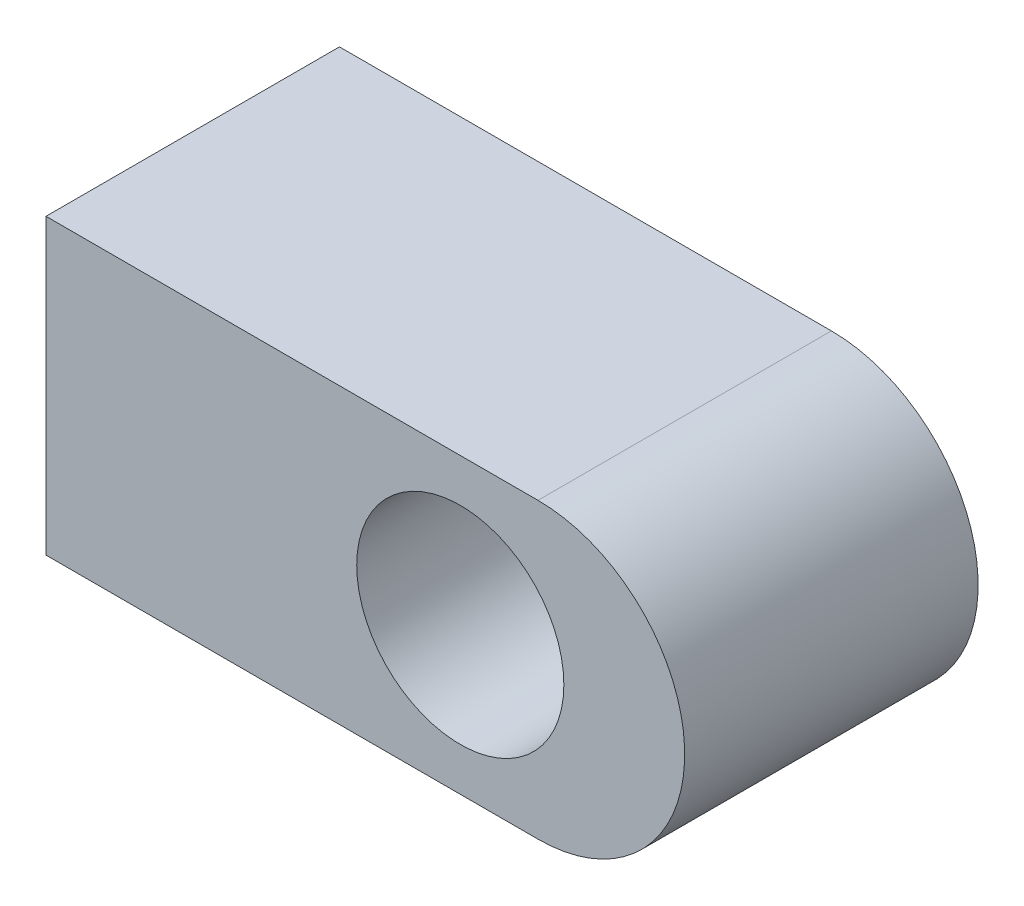
ISO-10303-21;
HEADER;
FILE_DESCRIPTION(('STEP AP214'),'2;1');
FILE_NAME('part.step','',(''),(''),'','','');
FILE_SCHEMA(('AUTOMOTIVE_DESIGN { 1 0 10303 214 1 1 1 1 }'));
ENDSEC;
DATA;
#1=APPLICATION_CONTEXT('core data for automotive mechanical design processes');
#2=APPLICATION_PROTOCOL_DEFINITION('international standard','automotive_design',2000,#1);
#3=PRODUCT_CONTEXT('',#1,'mechanical');
#4=PRODUCT('Part','Part','',(#3));
#5=PRODUCT_RELATED_PRODUCT_CATEGORY('part','',(#4));
#6=PRODUCT_DEFINITION_FORMATION('','',#4);
#7=PRODUCT_DEFINITION_CONTEXT('part definition',#1,'design');
#8=PRODUCT_DEFINITION('design','',#6,#7);
#9=PRODUCT_DEFINITION_SHAPE('','',#8);
#10=(LENGTH_UNIT() NAMED_UNIT(*) SI_UNIT(.MILLI.,.METRE.));
#11=(NAMED_UNIT(*) PLANE_ANGLE_UNIT() SI_UNIT($,.RADIAN.));
#12=(NAMED_UNIT(*) SI_UNIT($,.STERADIAN.) SOLID_ANGLE_UNIT());
#13=UNCERTAINTY_MEASURE_WITH_UNIT(LENGTH_MEASURE(1.E-05),#10,'distance_accuracy_value','');
#14=(GEOMETRIC_REPRESENTATION_CONTEXT(3) GLOBAL_UNCERTAINTY_ASSIGNED_CONTEXT((#13)) GLOBAL_UNIT_ASSIGNED_CONTEXT((#10,
#11,#12)) REPRESENTATION_CONTEXT('',''));
#15=CARTESIAN_POINT('',(0.,0.,0.));
#16=DIRECTION('',(0.,0.,1.));
#17=DIRECTION('',(1.,0.,0.));
#18=AXIS2_PLACEMENT_3D('',#15,#16,#17);
#19=CARTESIAN_POINT('',(13.970807503054,10.5154639175258,-17.));
#20=DIRECTION('',(0.,0.,1.));
#21=DIRECTION('',(1.,0.,0.));
#22=AXIS2_PLACEMENT_3D('',#19,#20,#21);
#23=CYLINDRICAL_SURFACE('',#22,17.);
#24=DIRECTION('',(0.,0.,1.));
#25=VECTOR('',#24,1.);
#26=CARTESIAN_POINT('',(13.970807503054,27.5154639175258,-17.));
#27=LINE('',#26,#25);
#28=CARTESIAN_POINT('',(13.970807503054,27.5154639175258,-17.));
#29=VERTEX_POINT('',#28);
#30=CARTESIAN_POINT('',(13.970807503054,27.5154639175258,17.));
#31=VERTEX_POINT('',#30);
#32=EDGE_CURVE('E39',#29,#31,#27,.T.);
#33=ORIENTED_EDGE('',*,*,#32,.T.);
#34=CARTESIAN_POINT('',(13.970807503054,10.5154639175258,17.));
#35=DIRECTION('',(0.,0.,1.));
#36=DIRECTION('',(1.,0.,0.));
#37=AXIS2_PLACEMENT_3D('',#34,#35,#36);
#38=CIRCLE('',#37,17.);
#39=CARTESIAN_POINT('',(13.970807503054,-6.48453608247421,17.));
#40=VERTEX_POINT('',#39);
#41=EDGE_CURVE('E79',#31,#40,#38,.F.);
#42=ORIENTED_EDGE('',*,*,#41,.T.);
#43=DIRECTION('',(0.,0.,1.));
#44=VECTOR('',#43,1.);
#45=CARTESIAN_POINT('',(13.970807503054,-6.48453608247421,-17.));
#46=LINE('',#45,#44);
#47=CARTESIAN_POINT('',(13.970807503054,-6.48453608247421,-17.));
#48=VERTEX_POINT('',#47);
#49=EDGE_CURVE('E11',#48,#40,#46,.T.);
#50=ORIENTED_EDGE('',*,*,#49,.F.);
#51=CARTESIAN_POINT('',(13.970807503054,10.5154639175258,-17.));
#52=DIRECTION('',(0.,0.,1.));
#53=DIRECTION('',(1.,0.,0.));
#54=AXIS2_PLACEMENT_3D('',#51,#52,#53);
#55=CIRCLE('',#54,17.);
#56=EDGE_CURVE('E52',#29,#48,#55,.F.);
#57=ORIENTED_EDGE('',*,*,#56,.F.);
#58=EDGE_LOOP('',(#33,#42,#50,#57));
#59=FACE_BOUND('',#58,.T.);
#60=ADVANCED_FACE('F35',(#59),#23,.T.);
#61=CARTESIAN_POINT('',(0.,-6.48453608247421,-17.));
#62=DIRECTION('',(0.,-1.,0.));
#63=DIRECTION('',(0.,0.,-1.));
#64=AXIS2_PLACEMENT_3D('',#61,#62,#63);
#65=PLANE('',#64);
#66=ORIENTED_EDGE('',*,*,#49,.T.);
#67=DIRECTION('',(1.,0.,0.));
#68=VECTOR('',#67,1.);
#69=CARTESIAN_POINT('',(0.,-6.48453608247421,17.));
#70=LINE('',#69,#68);
#71=CARTESIAN_POINT('',(-43.029192496946,-6.48453608247421,17.));
#72=VERTEX_POINT('',#71);
#73=EDGE_CURVE('E91',#72,#40,#70,.T.);
#74=ORIENTED_EDGE('',*,*,#73,.F.);
#75=DIRECTION('',(0.,0.,1.));
#76=VECTOR('',#75,1.);
#77=CARTESIAN_POINT('',(-43.029192496946,-6.48453608247421,-17.));
#78=LINE('',#77,#76);
#79=CARTESIAN_POINT('',(-43.029192496946,-6.48453608247421,-17.));
#80=VERTEX_POINT('',#79);
#81=EDGE_CURVE('E44',#80,#72,#78,.T.);
#82=ORIENTED_EDGE('',*,*,#81,.F.);
#83=DIRECTION('',(1.,0.,0.));
#84=VECTOR('',#83,1.);
#85=CARTESIAN_POINT('',(0.,-6.48453608247421,-17.));
#86=LINE('',#85,#84);
#87=EDGE_CURVE('E84',#80,#48,#86,.T.);
#88=ORIENTED_EDGE('',*,*,#87,.T.);
#89=EDGE_LOOP('',(#66,#74,#82,#88));
#90=FACE_BOUND('',#89,.T.);
#91=ADVANCED_FACE('F114',(#90),#65,.T.);
#92=CARTESIAN_POINT('',(-43.029192496946,0.,-17.));
#93=DIRECTION('',(-1.,0.,0.));
#94=DIRECTION('',(0.,0.,1.));
#95=AXIS2_PLACEMENT_3D('',#92,#93,#94);
#96=PLANE('',#95);
#97=ORIENTED_EDGE('',*,*,#81,.T.);
#98=DIRECTION('',(0.,-1.,0.));
#99=VECTOR('',#98,1.);
#100=CARTESIAN_POINT('',(-43.029192496946,0.,17.));
#101=LINE('',#100,#99);
#102=CARTESIAN_POINT('',(-43.029192496946,27.5154639175258,17.));
#103=VERTEX_POINT('',#102);
#104=EDGE_CURVE('E96',#103,#72,#101,.T.);
#105=ORIENTED_EDGE('',*,*,#104,.F.);
#106=DIRECTION('',(0.,0.,1.));
#107=VECTOR('',#106,1.);
#108=CARTESIAN_POINT('',(-43.029192496946,27.5154639175258,-17.));
#109=LINE('',#108,#107);
#110=CARTESIAN_POINT('',(-43.029192496946,27.5154639175258,-17.));
#111=VERTEX_POINT('',#110);
#112=EDGE_CURVE('E83',#111,#103,#109,.T.);
#113=ORIENTED_EDGE('',*,*,#112,.F.);
#114=DIRECTION('',(0.,-1.,0.));
#115=VECTOR('',#114,1.);
#116=CARTESIAN_POINT('',(-43.029192496946,0.,-17.));
#117=LINE('',#116,#115);
#118=EDGE_CURVE('E108',#111,#80,#117,.T.);
#119=ORIENTED_EDGE('',*,*,#118,.T.);
#120=EDGE_LOOP('',(#97,#105,#113,#119));
#121=FACE_BOUND('',#120,.T.);
#122=ADVANCED_FACE('F112',(#121),#96,.T.);
#123=CARTESIAN_POINT('',(4.97080750305396,10.5154639175258,-17.));
#124=DIRECTION('',(0.,0.,1.));
#125=DIRECTION('',(1.,0.,0.));
#126=AXIS2_PLACEMENT_3D('',#123,#124,#125);
#127=CYLINDRICAL_SURFACE('',#126,12.);
#128=CARTESIAN_POINT('',(4.97080750305396,10.5154639175258,-17.));
#129=DIRECTION('',(0.,0.,1.));
#130=DIRECTION('',(1.,0.,0.));
#131=AXIS2_PLACEMENT_3D('',#128,#129,#130);
#132=CIRCLE('',#131,12.);
#133=CARTESIAN_POINT('',(16.970807503054,10.5154639175258,-17.));
#134=VERTEX_POINT('',#133);
#135=EDGE_CURVE('E102',#134,#134,#132,.T.);
#136=ORIENTED_EDGE('',*,*,#135,.F.);
#137=EDGE_LOOP('',(#136));
#138=FACE_BOUND('',#137,.T.);
#139=CARTESIAN_POINT('',(4.97080750305396,10.5154639175258,17.));
#140=DIRECTION('',(0.,0.,1.));
#141=DIRECTION('',(1.,0.,0.));
#142=AXIS2_PLACEMENT_3D('',#139,#140,#141);
#143=CIRCLE('',#142,12.);
#144=CARTESIAN_POINT('',(16.970807503054,10.5154639175258,17.));
#145=VERTEX_POINT('',#144);
#146=EDGE_CURVE('E92',#145,#145,#143,.T.);
#147=ORIENTED_EDGE('',*,*,#146,.T.);
#148=EDGE_LOOP('',(#147));
#149=FACE_BOUND('',#148,.T.);
#150=ADVANCED_FACE('F37',(#138,#149),#127,.F.);
#151=CARTESIAN_POINT('',(0.,27.5154639175258,-17.));
#152=DIRECTION('',(0.,-1.,0.));
#153=DIRECTION('',(0.,0.,-1.));
#154=AXIS2_PLACEMENT_3D('',#151,#152,#153);
#155=PLANE('',#154);
#156=ORIENTED_EDGE('',*,*,#112,.T.);
#157=DIRECTION('',(1.,0.,0.));
#158=VECTOR('',#157,1.);
#159=CARTESIAN_POINT('',(0.,27.5154639175258,17.));
#160=LINE('',#159,#158);
#161=EDGE_CURVE('E90',#103,#31,#160,.T.);
#162=ORIENTED_EDGE('',*,*,#161,.T.);
#163=ORIENTED_EDGE('',*,*,#32,.F.);
#164=DIRECTION('',(1.,0.,0.));
#165=VECTOR('',#164,1.);
#166=CARTESIAN_POINT('',(0.,27.5154639175258,-17.));
#167=LINE('',#166,#165);
#168=EDGE_CURVE('E106',#111,#29,#167,.T.);
#169=ORIENTED_EDGE('',*,*,#168,.F.);
#170=EDGE_LOOP('',(#156,#162,#163,#169));
#171=FACE_BOUND('',#170,.T.);
#172=ADVANCED_FACE('F94',(#171),#155,.F.);
#173=CARTESIAN_POINT('',(0.,0.,-17.));
#174=DIRECTION('',(0.,0.,1.));
#175=DIRECTION('',(1.,0.,0.));
#176=AXIS2_PLACEMENT_3D('',#173,#174,#175);
#177=PLANE('',#176);
#178=ORIENTED_EDGE('',*,*,#135,.T.);
#179=EDGE_LOOP('',(#178));
#180=FACE_BOUND('',#179,.T.);
#181=ORIENTED_EDGE('',*,*,#56,.T.);
#182=ORIENTED_EDGE('',*,*,#87,.F.);
#183=ORIENTED_EDGE('',*,*,#118,.F.);
#184=ORIENTED_EDGE('',*,*,#168,.T.);
#185=EDGE_LOOP('',(#181,#182,#183,#184));
#186=FACE_BOUND('',#185,.T.);
#187=ADVANCED_FACE('F115',(#180,#186),#177,.F.);
#188=CARTESIAN_POINT('',(0.,0.,17.));
#189=DIRECTION('',(0.,0.,1.));
#190=DIRECTION('',(1.,0.,0.));
#191=AXIS2_PLACEMENT_3D('',#188,#189,#190);
#192=PLANE('',#191);
#193=ORIENTED_EDGE('',*,*,#146,.F.);
#194=EDGE_LOOP('',(#193));
#195=FACE_BOUND('',#194,.T.);
#196=ORIENTED_EDGE('',*,*,#41,.F.);
#197=ORIENTED_EDGE('',*,*,#161,.F.);
#198=ORIENTED_EDGE('',*,*,#104,.T.);
#199=ORIENTED_EDGE('',*,*,#73,.T.);
#200=EDGE_LOOP('',(#196,#197,#198,#199));
#201=FACE_BOUND('',#200,.T.);
#202=ADVANCED_FACE('F88',(#195,#201),#192,.T.);
#203=CLOSED_SHELL('',(#60,#91,#122,#150,#172,#187,#202));
#204=MANIFOLD_SOLID_BREP('B2',#203);
#205=ADVANCED_BREP_SHAPE_REPRESENTATION('',(#18,#204),#14);
#206=SHAPE_DEFINITION_REPRESENTATION(#9,#205);
ENDSEC;
END-ISO-10303-21;
